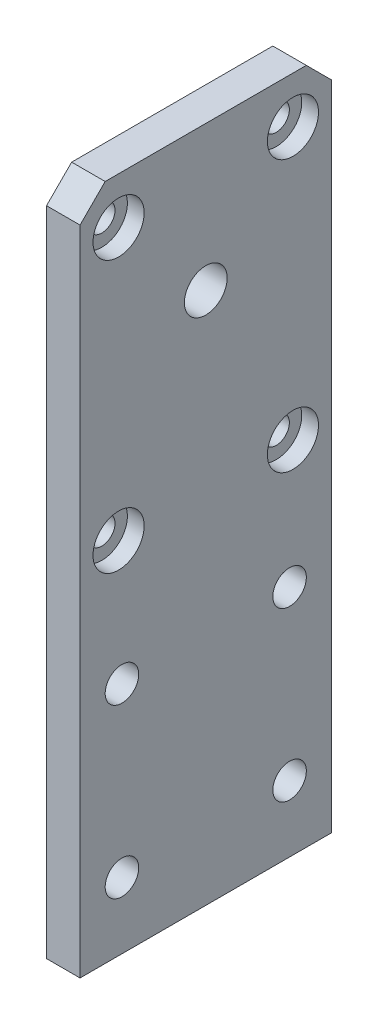
ISO-10303-21;
HEADER;
FILE_DESCRIPTION(('STEP AP214'),'2;1');
FILE_NAME('part.step','',(''),(''),'','','');
FILE_SCHEMA(('AUTOMOTIVE_DESIGN { 1 0 10303 214 1 1 1 1 }'));
ENDSEC;
DATA;
#1=APPLICATION_CONTEXT('core data for automotive mechanical design processes');
#2=APPLICATION_PROTOCOL_DEFINITION('international standard','automotive_design',2000,#1);
#3=PRODUCT_CONTEXT('',#1,'mechanical');
#4=PRODUCT('Part','Part','',(#3));
#5=PRODUCT_RELATED_PRODUCT_CATEGORY('part','',(#4));
#6=PRODUCT_DEFINITION_FORMATION('','',#4);
#7=PRODUCT_DEFINITION_CONTEXT('part definition',#1,'design');
#8=PRODUCT_DEFINITION('design','',#6,#7);
#9=PRODUCT_DEFINITION_SHAPE('','',#8);
#10=(LENGTH_UNIT() NAMED_UNIT(*) SI_UNIT(.MILLI.,.METRE.));
#11=(NAMED_UNIT(*) PLANE_ANGLE_UNIT() SI_UNIT($,.RADIAN.));
#12=(NAMED_UNIT(*) SI_UNIT($,.STERADIAN.) SOLID_ANGLE_UNIT());
#13=UNCERTAINTY_MEASURE_WITH_UNIT(LENGTH_MEASURE(1.E-05),#10,'distance_accuracy_value','');
#14=(GEOMETRIC_REPRESENTATION_CONTEXT(3) GLOBAL_UNCERTAINTY_ASSIGNED_CONTEXT((#13)) GLOBAL_UNIT_ASSIGNED_CONTEXT((#10,
#11,#12)) REPRESENTATION_CONTEXT('',''));
#15=CARTESIAN_POINT('',(0.,0.,0.));
#16=DIRECTION('',(0.,0.,1.));
#17=DIRECTION('',(1.,0.,0.));
#18=AXIS2_PLACEMENT_3D('',#15,#16,#17);
#19=CARTESIAN_POINT('',(4.,-40.4,-15.));
#20=DIRECTION('',(0.,0.,1.));
#21=DIRECTION('',(1.,0.,0.));
#22=AXIS2_PLACEMENT_3D('',#19,#20,#21);
#23=PLANE('',#22);
#24=DIRECTION('',(0.,1.,0.));
#25=VECTOR('',#24,1.);
#26=CARTESIAN_POINT('',(0.,-40.4,-15.));
#27=LINE('',#26,#25);
#28=CARTESIAN_POINT('',(0.,-40.4,-15.));
#29=VERTEX_POINT('',#28);
#30=CARTESIAN_POINT('',(0.,37.4,-15.));
#31=VERTEX_POINT('',#30);
#32=EDGE_CURVE('E111',#29,#31,#27,.T.);
#33=ORIENTED_EDGE('',*,*,#32,.T.);
#34=DIRECTION('',(1.,0.,0.));
#35=VECTOR('',#34,1.);
#36=CARTESIAN_POINT('',(4.,37.4,-15.));
#37=LINE('',#36,#35);
#38=CARTESIAN_POINT('',(4.,37.3999999999999,-15.));
#39=VERTEX_POINT('',#38);
#40=EDGE_CURVE('E55',#31,#39,#37,.T.);
#41=ORIENTED_EDGE('',*,*,#40,.T.);
#42=DIRECTION('',(0.,1.,0.));
#43=VECTOR('',#42,1.);
#44=CARTESIAN_POINT('',(4.,-40.4,-15.));
#45=LINE('',#44,#43);
#46=CARTESIAN_POINT('',(4.,-40.4,-15.));
#47=VERTEX_POINT('',#46);
#48=EDGE_CURVE('E119',#47,#39,#45,.T.);
#49=ORIENTED_EDGE('',*,*,#48,.F.);
#50=DIRECTION('',(-1.,0.,0.));
#51=VECTOR('',#50,1.);
#52=CARTESIAN_POINT('',(4.,-40.4,-15.));
#53=LINE('',#52,#51);
#54=EDGE_CURVE('E103',#47,#29,#53,.T.);
#55=ORIENTED_EDGE('',*,*,#54,.T.);
#56=EDGE_LOOP('',(#33,#41,#49,#55));
#57=FACE_BOUND('',#56,.T.);
#58=ADVANCED_FACE('F32',(#57),#23,.F.);
#59=CARTESIAN_POINT('',(4.,40.4,15.));
#60=DIRECTION('',(0.,-1.,0.));
#61=DIRECTION('',(0.,0.,-1.));
#62=AXIS2_PLACEMENT_3D('',#59,#60,#61);
#63=PLANE('',#62);
#64=DIRECTION('',(0.,0.,1.));
#65=VECTOR('',#64,1.);
#66=CARTESIAN_POINT('',(4.,40.4,15.));
#67=LINE('',#66,#65);
#68=CARTESIAN_POINT('',(4.,40.4,-12.));
#69=VERTEX_POINT('',#68);
#70=CARTESIAN_POINT('',(4.,40.4,12.));
#71=VERTEX_POINT('',#70);
#72=EDGE_CURVE('E93',#69,#71,#67,.T.);
#73=ORIENTED_EDGE('',*,*,#72,.F.);
#74=DIRECTION('',(-1.,0.,0.));
#75=VECTOR('',#74,1.);
#76=CARTESIAN_POINT('',(4.,40.4,-12.));
#77=LINE('',#76,#75);
#78=CARTESIAN_POINT('',(0.,40.4,-12.));
#79=VERTEX_POINT('',#78);
#80=EDGE_CURVE('E122',#69,#79,#77,.T.);
#81=ORIENTED_EDGE('',*,*,#80,.T.);
#82=DIRECTION('',(0.,0.,1.));
#83=VECTOR('',#82,1.);
#84=CARTESIAN_POINT('',(0.,40.4,15.));
#85=LINE('',#84,#83);
#86=CARTESIAN_POINT('',(0.,40.4,12.));
#87=VERTEX_POINT('',#86);
#88=EDGE_CURVE('E113',#79,#87,#85,.T.);
#89=ORIENTED_EDGE('',*,*,#88,.T.);
#90=DIRECTION('',(1.,0.,0.));
#91=VECTOR('',#90,1.);
#92=CARTESIAN_POINT('',(4.,40.4,12.));
#93=LINE('',#92,#91);
#94=EDGE_CURVE('E102',#87,#71,#93,.T.);
#95=ORIENTED_EDGE('',*,*,#94,.T.);
#96=EDGE_LOOP('',(#73,#81,#89,#95));
#97=FACE_BOUND('',#96,.T.);
#98=ADVANCED_FACE('F135',(#97),#63,.F.);
#99=CARTESIAN_POINT('',(4.,-40.4,15.));
#100=DIRECTION('',(0.,0.,-1.));
#101=DIRECTION('',(-1.,0.,0.));
#102=AXIS2_PLACEMENT_3D('',#99,#100,#101);
#103=PLANE('',#102);
#104=DIRECTION('',(0.,-1.,0.));
#105=VECTOR('',#104,1.);
#106=CARTESIAN_POINT('',(4.,-40.4,15.));
#107=LINE('',#106,#105);
#108=CARTESIAN_POINT('',(4.,37.4,15.));
#109=VERTEX_POINT('',#108);
#110=CARTESIAN_POINT('',(4.,-40.4,15.));
#111=VERTEX_POINT('',#110);
#112=EDGE_CURVE('E85',#109,#111,#107,.T.);
#113=ORIENTED_EDGE('',*,*,#112,.F.);
#114=DIRECTION('',(-1.,0.,0.));
#115=VECTOR('',#114,1.);
#116=CARTESIAN_POINT('',(4.,37.4,15.));
#117=LINE('',#116,#115);
#118=CARTESIAN_POINT('',(0.,37.4,15.));
#119=VERTEX_POINT('',#118);
#120=EDGE_CURVE('E11',#109,#119,#117,.T.);
#121=ORIENTED_EDGE('',*,*,#120,.T.);
#122=DIRECTION('',(0.,-1.,0.));
#123=VECTOR('',#122,1.);
#124=CARTESIAN_POINT('',(0.,-40.4,15.));
#125=LINE('',#124,#123);
#126=CARTESIAN_POINT('',(0.,-40.4,15.));
#127=VERTEX_POINT('',#126);
#128=EDGE_CURVE('E99',#119,#127,#125,.T.);
#129=ORIENTED_EDGE('',*,*,#128,.T.);
#130=DIRECTION('',(-1.,0.,0.));
#131=VECTOR('',#130,1.);
#132=CARTESIAN_POINT('',(4.,-40.4,15.));
#133=LINE('',#132,#131);
#134=EDGE_CURVE('E96',#111,#127,#133,.T.);
#135=ORIENTED_EDGE('',*,*,#134,.F.);
#136=EDGE_LOOP('',(#113,#121,#129,#135));
#137=FACE_BOUND('',#136,.T.);
#138=ADVANCED_FACE('F97',(#137),#103,.F.);
#139=CARTESIAN_POINT('',(4.,-40.4,15.));
#140=DIRECTION('',(0.,1.,0.));
#141=DIRECTION('',(0.,0.,1.));
#142=AXIS2_PLACEMENT_3D('',#139,#140,#141);
#143=PLANE('',#142);
#144=DIRECTION('',(0.,0.,-1.));
#145=VECTOR('',#144,1.);
#146=CARTESIAN_POINT('',(0.,-40.4,15.));
#147=LINE('',#146,#145);
#148=EDGE_CURVE('E118',#127,#29,#147,.T.);
#149=ORIENTED_EDGE('',*,*,#148,.T.);
#150=ORIENTED_EDGE('',*,*,#54,.F.);
#151=DIRECTION('',(0.,0.,-1.));
#152=VECTOR('',#151,1.);
#153=CARTESIAN_POINT('',(4.,-40.4,15.));
#154=LINE('',#153,#152);
#155=EDGE_CURVE('E89',#111,#47,#154,.T.);
#156=ORIENTED_EDGE('',*,*,#155,.F.);
#157=ORIENTED_EDGE('',*,*,#134,.T.);
#158=EDGE_LOOP('',(#149,#150,#156,#157));
#159=FACE_BOUND('',#158,.T.);
#160=ADVANCED_FACE('F105',(#159),#143,.F.);
#161=CARTESIAN_POINT('',(4.,0.,0.));
#162=DIRECTION('',(-1.,0.,0.));
#163=DIRECTION('',(0.,0.,1.));
#164=AXIS2_PLACEMENT_3D('',#161,#162,#163);
#165=PLANE('',#164);
#166=CARTESIAN_POINT('',(4.,2.49999999999999,-10.4000000000002));
#167=DIRECTION('',(-1.,0.,0.));
#168=DIRECTION('',(0.,0.,1.));
#169=AXIS2_PLACEMENT_3D('',#166,#167,#168);
#170=CIRCLE('',#169,3.05);
#171=CARTESIAN_POINT('',(4.,2.49999999999999,-7.35000000000023));
#172=VERTEX_POINT('',#171);
#173=EDGE_CURVE('E192',#172,#172,#170,.T.);
#174=ORIENTED_EDGE('',*,*,#173,.T.);
#175=EDGE_LOOP('',(#174));
#176=FACE_BOUND('',#175,.T.);
#177=CARTESIAN_POINT('',(4.,2.49999999999999,10.3999999999998));
#178=DIRECTION('',(-1.,0.,0.));
#179=DIRECTION('',(0.,0.,1.));
#180=AXIS2_PLACEMENT_3D('',#177,#178,#179);
#181=CIRCLE('',#180,3.05);
#182=CARTESIAN_POINT('',(4.,2.49999999999999,13.4499999999998));
#183=VERTEX_POINT('',#182);
#184=EDGE_CURVE('E186',#183,#183,#181,.T.);
#185=ORIENTED_EDGE('',*,*,#184,.T.);
#186=EDGE_LOOP('',(#185));
#187=FACE_BOUND('',#186,.T.);
#188=CARTESIAN_POINT('',(4.,34.85,10.3999999999998));
#189=DIRECTION('',(-1.,0.,0.));
#190=DIRECTION('',(0.,0.,1.));
#191=AXIS2_PLACEMENT_3D('',#188,#189,#190);
#192=CIRCLE('',#191,3.04999999999999);
#193=CARTESIAN_POINT('',(4.,34.85,13.4499999999998));
#194=VERTEX_POINT('',#193);
#195=EDGE_CURVE('E180',#194,#194,#192,.T.);
#196=ORIENTED_EDGE('',*,*,#195,.T.);
#197=EDGE_LOOP('',(#196));
#198=FACE_BOUND('',#197,.T.);
#199=CARTESIAN_POINT('',(4.,34.85,-10.4000000000002));
#200=DIRECTION('',(-1.,0.,0.));
#201=DIRECTION('',(0.,0.,1.));
#202=AXIS2_PLACEMENT_3D('',#199,#200,#201);
#203=CIRCLE('',#202,3.04999999999999);
#204=CARTESIAN_POINT('',(4.,34.85,-7.35000000000023));
#205=VERTEX_POINT('',#204);
#206=EDGE_CURVE('E174',#205,#205,#203,.T.);
#207=ORIENTED_EDGE('',*,*,#206,.T.);
#208=EDGE_LOOP('',(#207));
#209=FACE_BOUND('',#208,.T.);
#210=CARTESIAN_POINT('',(4.,23.15,0.));
#211=DIRECTION('',(-1.,0.,0.));
#212=DIRECTION('',(0.,0.,1.));
#213=AXIS2_PLACEMENT_3D('',#210,#211,#212);
#214=CIRCLE('',#213,2.55);
#215=CARTESIAN_POINT('',(4.,23.15,2.55));
#216=VERTEX_POINT('',#215);
#217=EDGE_CURVE('E165',#216,#216,#214,.T.);
#218=ORIENTED_EDGE('',*,*,#217,.T.);
#219=EDGE_LOOP('',(#218));
#220=FACE_BOUND('',#219,.T.);
#221=CARTESIAN_POINT('',(4.,-32.5,-10.));
#222=DIRECTION('',(1.,0.,0.));
#223=DIRECTION('',(0.,0.,-1.));
#224=AXIS2_PLACEMENT_3D('',#221,#222,#223);
#225=CIRCLE('',#224,2.00000000000001);
#226=CARTESIAN_POINT('',(4.,-32.5,-12.));
#227=VERTEX_POINT('',#226);
#228=EDGE_CURVE('E162',#227,#227,#225,.T.);
#229=ORIENTED_EDGE('',*,*,#228,.F.);
#230=EDGE_LOOP('',(#229));
#231=FACE_BOUND('',#230,.T.);
#232=CARTESIAN_POINT('',(4.,-32.5,10.));
#233=DIRECTION('',(1.,0.,0.));
#234=DIRECTION('',(0.,0.,-1.));
#235=AXIS2_PLACEMENT_3D('',#232,#233,#234);
#236=CIRCLE('',#235,2.);
#237=CARTESIAN_POINT('',(4.,-32.5,8.));
#238=VERTEX_POINT('',#237);
#239=EDGE_CURVE('E156',#238,#238,#236,.T.);
#240=ORIENTED_EDGE('',*,*,#239,.F.);
#241=EDGE_LOOP('',(#240));
#242=FACE_BOUND('',#241,.T.);
#243=CARTESIAN_POINT('',(4.,-12.5,-10.));
#244=DIRECTION('',(1.,0.,0.));
#245=DIRECTION('',(0.,0.,-1.));
#246=AXIS2_PLACEMENT_3D('',#243,#244,#245);
#247=CIRCLE('',#246,2.00000000000001);
#248=CARTESIAN_POINT('',(4.,-12.5,-12.));
#249=VERTEX_POINT('',#248);
#250=EDGE_CURVE('E150',#249,#249,#247,.T.);
#251=ORIENTED_EDGE('',*,*,#250,.F.);
#252=EDGE_LOOP('',(#251));
#253=FACE_BOUND('',#252,.T.);
#254=CARTESIAN_POINT('',(4.,-12.5,10.));
#255=DIRECTION('',(1.,0.,0.));
#256=DIRECTION('',(0.,0.,-1.));
#257=AXIS2_PLACEMENT_3D('',#254,#255,#256);
#258=CIRCLE('',#257,2.);
#259=CARTESIAN_POINT('',(4.,-12.5,8.));
#260=VERTEX_POINT('',#259);
#261=EDGE_CURVE('E144',#260,#260,#258,.T.);
#262=ORIENTED_EDGE('',*,*,#261,.F.);
#263=EDGE_LOOP('',(#262));
#264=FACE_BOUND('',#263,.T.);
#265=ORIENTED_EDGE('',*,*,#48,.T.);
#266=DIRECTION('',(0.,-0.707106781186548,-0.707106781186547));
#267=VECTOR('',#266,1.);
#268=CARTESIAN_POINT('',(4.,40.4,-12.));
#269=LINE('',#268,#267);
#270=EDGE_CURVE('E40',#39,#69,#269,.F.);
#271=ORIENTED_EDGE('',*,*,#270,.T.);
#272=ORIENTED_EDGE('',*,*,#72,.T.);
#273=DIRECTION('',(0.,0.707106781186545,-0.70710678118655));
#274=VECTOR('',#273,1.);
#275=CARTESIAN_POINT('',(4.,37.4,15.));
#276=LINE('',#275,#274);
#277=EDGE_CURVE('E47',#71,#109,#276,.F.);
#278=ORIENTED_EDGE('',*,*,#277,.T.);
#279=ORIENTED_EDGE('',*,*,#112,.T.);
#280=ORIENTED_EDGE('',*,*,#155,.T.);
#281=EDGE_LOOP('',(#265,#271,#272,#278,#279,#280));
#282=FACE_BOUND('',#281,.T.);
#283=ADVANCED_FACE('F87',(#176,#187,#198,#209,#220,#231,#242,#253,#264,#282),#165,.F.);
#284=CARTESIAN_POINT('',(0.,0.,0.));
#285=DIRECTION('',(-1.,0.,0.));
#286=DIRECTION('',(0.,0.,1.));
#287=AXIS2_PLACEMENT_3D('',#284,#285,#286);
#288=PLANE('',#287);
#289=CARTESIAN_POINT('',(0.,2.49999999999999,10.3999999999998));
#290=DIRECTION('',(1.,0.,0.));
#291=DIRECTION('',(0.,0.,-1.));
#292=AXIS2_PLACEMENT_3D('',#289,#290,#291);
#293=CIRCLE('',#292,1.575);
#294=CARTESIAN_POINT('',(0.,2.49999999999999,8.82499999999978));
#295=VERTEX_POINT('',#294);
#296=EDGE_CURVE('E213',#295,#295,#293,.T.);
#297=ORIENTED_EDGE('',*,*,#296,.T.);
#298=EDGE_LOOP('',(#297));
#299=FACE_BOUND('',#298,.T.);
#300=CARTESIAN_POINT('',(0.,2.49999999999999,-10.4000000000002));
#301=DIRECTION('',(1.,0.,0.));
#302=DIRECTION('',(0.,0.,-1.));
#303=AXIS2_PLACEMENT_3D('',#300,#301,#302);
#304=CIRCLE('',#303,1.575);
#305=CARTESIAN_POINT('',(0.,2.49999999999999,-11.9750000000002));
#306=VERTEX_POINT('',#305);
#307=EDGE_CURVE('E207',#306,#306,#304,.T.);
#308=ORIENTED_EDGE('',*,*,#307,.T.);
#309=EDGE_LOOP('',(#308));
#310=FACE_BOUND('',#309,.T.);
#311=CARTESIAN_POINT('',(0.,34.85,-10.4000000000002));
#312=DIRECTION('',(1.,0.,0.));
#313=DIRECTION('',(0.,0.,-1.));
#314=AXIS2_PLACEMENT_3D('',#311,#312,#313);
#315=CIRCLE('',#314,1.575);
#316=CARTESIAN_POINT('',(0.,34.85,-11.9750000000002));
#317=VERTEX_POINT('',#316);
#318=EDGE_CURVE('E201',#317,#317,#315,.T.);
#319=ORIENTED_EDGE('',*,*,#318,.T.);
#320=EDGE_LOOP('',(#319));
#321=FACE_BOUND('',#320,.T.);
#322=CARTESIAN_POINT('',(0.,34.85,10.3999999999998));
#323=DIRECTION('',(1.,0.,0.));
#324=DIRECTION('',(0.,0.,-1.));
#325=AXIS2_PLACEMENT_3D('',#322,#323,#324);
#326=CIRCLE('',#325,1.575);
#327=CARTESIAN_POINT('',(0.,34.85,8.82499999999979));
#328=VERTEX_POINT('',#327);
#329=EDGE_CURVE('E195',#328,#328,#326,.T.);
#330=ORIENTED_EDGE('',*,*,#329,.T.);
#331=EDGE_LOOP('',(#330));
#332=FACE_BOUND('',#331,.T.);
#333=CARTESIAN_POINT('',(0.,23.15,0.));
#334=DIRECTION('',(-1.,0.,0.));
#335=DIRECTION('',(0.,0.,1.));
#336=AXIS2_PLACEMENT_3D('',#333,#334,#335);
#337=CIRCLE('',#336,2.55);
#338=CARTESIAN_POINT('',(0.,23.15,2.55));
#339=VERTEX_POINT('',#338);
#340=EDGE_CURVE('E168',#339,#339,#337,.T.);
#341=ORIENTED_EDGE('',*,*,#340,.F.);
#342=EDGE_LOOP('',(#341));
#343=FACE_BOUND('',#342,.T.);
#344=CARTESIAN_POINT('',(0.,-32.5,-10.));
#345=DIRECTION('',(1.,0.,0.));
#346=DIRECTION('',(0.,0.,-1.));
#347=AXIS2_PLACEMENT_3D('',#344,#345,#346);
#348=CIRCLE('',#347,2.00000000000001);
#349=CARTESIAN_POINT('',(0.,-32.5,-12.));
#350=VERTEX_POINT('',#349);
#351=EDGE_CURVE('E159',#350,#350,#348,.T.);
#352=ORIENTED_EDGE('',*,*,#351,.T.);
#353=EDGE_LOOP('',(#352));
#354=FACE_BOUND('',#353,.T.);
#355=CARTESIAN_POINT('',(0.,-32.5,10.));
#356=DIRECTION('',(1.,0.,0.));
#357=DIRECTION('',(0.,0.,-1.));
#358=AXIS2_PLACEMENT_3D('',#355,#356,#357);
#359=CIRCLE('',#358,2.);
#360=CARTESIAN_POINT('',(0.,-32.5,8.));
#361=VERTEX_POINT('',#360);
#362=EDGE_CURVE('E153',#361,#361,#359,.T.);
#363=ORIENTED_EDGE('',*,*,#362,.T.);
#364=EDGE_LOOP('',(#363));
#365=FACE_BOUND('',#364,.T.);
#366=CARTESIAN_POINT('',(0.,-12.5,-10.));
#367=DIRECTION('',(1.,0.,0.));
#368=DIRECTION('',(0.,0.,-1.));
#369=AXIS2_PLACEMENT_3D('',#366,#367,#368);
#370=CIRCLE('',#369,2.00000000000001);
#371=CARTESIAN_POINT('',(0.,-12.5,-12.));
#372=VERTEX_POINT('',#371);
#373=EDGE_CURVE('E147',#372,#372,#370,.T.);
#374=ORIENTED_EDGE('',*,*,#373,.T.);
#375=EDGE_LOOP('',(#374));
#376=FACE_BOUND('',#375,.T.);
#377=CARTESIAN_POINT('',(0.,-12.5,10.));
#378=DIRECTION('',(1.,0.,0.));
#379=DIRECTION('',(0.,0.,-1.));
#380=AXIS2_PLACEMENT_3D('',#377,#378,#379);
#381=CIRCLE('',#380,2.);
#382=CARTESIAN_POINT('',(0.,-12.5,8.));
#383=VERTEX_POINT('',#382);
#384=EDGE_CURVE('E114',#383,#383,#381,.T.);
#385=ORIENTED_EDGE('',*,*,#384,.T.);
#386=EDGE_LOOP('',(#385));
#387=FACE_BOUND('',#386,.T.);
#388=ORIENTED_EDGE('',*,*,#88,.F.);
#389=DIRECTION('',(0.,0.707106781186548,0.707106781186547));
#390=VECTOR('',#389,1.);
#391=CARTESIAN_POINT('',(0.,26.1999999999999,-26.2));
#392=LINE('',#391,#390);
#393=EDGE_CURVE('E127',#79,#31,#392,.F.);
#394=ORIENTED_EDGE('',*,*,#393,.T.);
#395=ORIENTED_EDGE('',*,*,#32,.F.);
#396=ORIENTED_EDGE('',*,*,#148,.F.);
#397=ORIENTED_EDGE('',*,*,#128,.F.);
#398=DIRECTION('',(0.,-0.707106781186545,0.70710678118655));
#399=VECTOR('',#398,1.);
#400=CARTESIAN_POINT('',(0.,26.2000000000001,26.1999999999999));
#401=LINE('',#400,#399);
#402=EDGE_CURVE('E125',#119,#87,#401,.F.);
#403=ORIENTED_EDGE('',*,*,#402,.T.);
#404=EDGE_LOOP('',(#388,#394,#395,#396,#397,#403));
#405=FACE_BOUND('',#404,.T.);
#406=ADVANCED_FACE('F141',(#299,#310,#321,#332,#343,#354,#365,#376,#387,#405),#288,.T.);
#407=CARTESIAN_POINT('',(0.,-12.5,10.));
#408=DIRECTION('',(1.,0.,0.));
#409=DIRECTION('',(0.,0.,-1.));
#410=AXIS2_PLACEMENT_3D('',#407,#408,#409);
#411=CYLINDRICAL_SURFACE('',#410,2.);
#412=ORIENTED_EDGE('',*,*,#384,.F.);
#413=EDGE_LOOP('',(#412));
#414=FACE_BOUND('',#413,.T.);
#415=ORIENTED_EDGE('',*,*,#261,.T.);
#416=EDGE_LOOP('',(#415));
#417=FACE_BOUND('',#416,.T.);
#418=ADVANCED_FACE('F263',(#414,#417),#411,.F.);
#419=CARTESIAN_POINT('',(0.,-12.5,-10.));
#420=DIRECTION('',(1.,0.,0.));
#421=DIRECTION('',(0.,0.,-1.));
#422=AXIS2_PLACEMENT_3D('',#419,#420,#421);
#423=CYLINDRICAL_SURFACE('',#422,2.00000000000001);
#424=ORIENTED_EDGE('',*,*,#373,.F.);
#425=EDGE_LOOP('',(#424));
#426=FACE_BOUND('',#425,.T.);
#427=ORIENTED_EDGE('',*,*,#250,.T.);
#428=EDGE_LOOP('',(#427));
#429=FACE_BOUND('',#428,.T.);
#430=ADVANCED_FACE('F265',(#426,#429),#423,.F.);
#431=CARTESIAN_POINT('',(0.,-32.5,10.));
#432=DIRECTION('',(1.,0.,0.));
#433=DIRECTION('',(0.,0.,-1.));
#434=AXIS2_PLACEMENT_3D('',#431,#432,#433);
#435=CYLINDRICAL_SURFACE('',#434,2.);
#436=ORIENTED_EDGE('',*,*,#362,.F.);
#437=EDGE_LOOP('',(#436));
#438=FACE_BOUND('',#437,.T.);
#439=ORIENTED_EDGE('',*,*,#239,.T.);
#440=EDGE_LOOP('',(#439));
#441=FACE_BOUND('',#440,.T.);
#442=ADVANCED_FACE('F272',(#438,#441),#435,.F.);
#443=CARTESIAN_POINT('',(0.,-32.5,-10.));
#444=DIRECTION('',(1.,0.,0.));
#445=DIRECTION('',(0.,0.,-1.));
#446=AXIS2_PLACEMENT_3D('',#443,#444,#445);
#447=CYLINDRICAL_SURFACE('',#446,2.00000000000001);
#448=ORIENTED_EDGE('',*,*,#351,.F.);
#449=EDGE_LOOP('',(#448));
#450=FACE_BOUND('',#449,.T.);
#451=ORIENTED_EDGE('',*,*,#228,.T.);
#452=EDGE_LOOP('',(#451));
#453=FACE_BOUND('',#452,.T.);
#454=ADVANCED_FACE('F442',(#450,#453),#447,.F.);
#455=CARTESIAN_POINT('',(4.,23.15,0.));
#456=DIRECTION('',(-1.,0.,0.));
#457=DIRECTION('',(0.,0.,1.));
#458=AXIS2_PLACEMENT_3D('',#455,#456,#457);
#459=CYLINDRICAL_SURFACE('',#458,2.55);
#460=ORIENTED_EDGE('',*,*,#217,.F.);
#461=EDGE_LOOP('',(#460));
#462=FACE_BOUND('',#461,.T.);
#463=ORIENTED_EDGE('',*,*,#340,.T.);
#464=EDGE_LOOP('',(#463));
#465=FACE_BOUND('',#464,.T.);
#466=ADVANCED_FACE('F432',(#462,#465),#459,.F.);
#467=CARTESIAN_POINT('',(2.,34.85,-10.4000000000002));
#468=DIRECTION('',(1.,0.,0.));
#469=DIRECTION('',(0.,0.,-1.));
#470=AXIS2_PLACEMENT_3D('',#467,#468,#469);
#471=CYLINDRICAL_SURFACE('',#470,3.04999999999999);
#472=CARTESIAN_POINT('',(2.,34.85,-10.4000000000002));
#473=DIRECTION('',(-1.,0.,0.));
#474=DIRECTION('',(0.,0.,1.));
#475=AXIS2_PLACEMENT_3D('',#472,#473,#474);
#476=CIRCLE('',#475,3.04999999999999);
#477=CARTESIAN_POINT('',(2.,34.85,-7.35000000000023));
#478=VERTEX_POINT('',#477);
#479=EDGE_CURVE('E171',#478,#478,#476,.T.);
#480=ORIENTED_EDGE('',*,*,#479,.T.);
#481=EDGE_LOOP('',(#480));
#482=FACE_BOUND('',#481,.T.);
#483=ORIENTED_EDGE('',*,*,#206,.F.);
#484=EDGE_LOOP('',(#483));
#485=FACE_BOUND('',#484,.T.);
#486=ADVANCED_FACE('F403',(#482,#485),#471,.F.);
#487=CARTESIAN_POINT('',(2.,34.85,-10.4000000000002));
#488=DIRECTION('',(-1.,0.,0.));
#489=DIRECTION('',(0.,0.,1.));
#490=AXIS2_PLACEMENT_3D('',#487,#488,#489);
#491=PLANE('',#490);
#492=CARTESIAN_POINT('',(2.,34.85,-10.4000000000002));
#493=DIRECTION('',(1.,0.,0.));
#494=DIRECTION('',(0.,0.,-1.));
#495=AXIS2_PLACEMENT_3D('',#492,#493,#494);
#496=CIRCLE('',#495,1.575);
#497=CARTESIAN_POINT('',(2.,34.85,-11.9750000000002));
#498=VERTEX_POINT('',#497);
#499=EDGE_CURVE('E204',#498,#498,#496,.T.);
#500=ORIENTED_EDGE('',*,*,#499,.F.);
#501=EDGE_LOOP('',(#500));
#502=FACE_BOUND('',#501,.T.);
#503=ORIENTED_EDGE('',*,*,#479,.F.);
#504=EDGE_LOOP('',(#503));
#505=FACE_BOUND('',#504,.T.);
#506=ADVANCED_FACE('F398',(#502,#505),#491,.F.);
#507=CARTESIAN_POINT('',(2.,34.85,10.3999999999998));
#508=DIRECTION('',(1.,0.,0.));
#509=DIRECTION('',(0.,0.,-1.));
#510=AXIS2_PLACEMENT_3D('',#507,#508,#509);
#511=CYLINDRICAL_SURFACE('',#510,3.04999999999999);
#512=CARTESIAN_POINT('',(2.,34.85,10.3999999999998));
#513=DIRECTION('',(-1.,0.,0.));
#514=DIRECTION('',(0.,0.,1.));
#515=AXIS2_PLACEMENT_3D('',#512,#513,#514);
#516=CIRCLE('',#515,3.04999999999999);
#517=CARTESIAN_POINT('',(2.,34.85,13.4499999999998));
#518=VERTEX_POINT('',#517);
#519=EDGE_CURVE('E177',#518,#518,#516,.T.);
#520=ORIENTED_EDGE('',*,*,#519,.T.);
#521=EDGE_LOOP('',(#520));
#522=FACE_BOUND('',#521,.T.);
#523=ORIENTED_EDGE('',*,*,#195,.F.);
#524=EDGE_LOOP('',(#523));
#525=FACE_BOUND('',#524,.T.);
#526=ADVANCED_FACE('F390',(#522,#525),#511,.F.);
#527=CARTESIAN_POINT('',(2.,34.85,10.3999999999998));
#528=DIRECTION('',(-1.,0.,0.));
#529=DIRECTION('',(0.,0.,1.));
#530=AXIS2_PLACEMENT_3D('',#527,#528,#529);
#531=PLANE('',#530);
#532=CARTESIAN_POINT('',(2.,34.85,10.3999999999998));
#533=DIRECTION('',(1.,0.,0.));
#534=DIRECTION('',(0.,0.,-1.));
#535=AXIS2_PLACEMENT_3D('',#532,#533,#534);
#536=CIRCLE('',#535,1.575);
#537=CARTESIAN_POINT('',(2.,34.85,8.82499999999979));
#538=VERTEX_POINT('',#537);
#539=EDGE_CURVE('E198',#538,#538,#536,.T.);
#540=ORIENTED_EDGE('',*,*,#539,.F.);
#541=EDGE_LOOP('',(#540));
#542=FACE_BOUND('',#541,.T.);
#543=ORIENTED_EDGE('',*,*,#519,.F.);
#544=EDGE_LOOP('',(#543));
#545=FACE_BOUND('',#544,.T.);
#546=ADVANCED_FACE('F241',(#542,#545),#531,.F.);
#547=CARTESIAN_POINT('',(2.,2.49999999999999,10.3999999999998));
#548=DIRECTION('',(1.,0.,0.));
#549=DIRECTION('',(0.,0.,-1.));
#550=AXIS2_PLACEMENT_3D('',#547,#548,#549);
#551=CYLINDRICAL_SURFACE('',#550,3.05);
#552=CARTESIAN_POINT('',(2.,2.49999999999999,10.3999999999998));
#553=DIRECTION('',(-1.,0.,0.));
#554=DIRECTION('',(0.,0.,1.));
#555=AXIS2_PLACEMENT_3D('',#552,#553,#554);
#556=CIRCLE('',#555,3.05);
#557=CARTESIAN_POINT('',(2.,2.49999999999999,13.4499999999998));
#558=VERTEX_POINT('',#557);
#559=EDGE_CURVE('E183',#558,#558,#556,.T.);
#560=ORIENTED_EDGE('',*,*,#559,.T.);
#561=EDGE_LOOP('',(#560));
#562=FACE_BOUND('',#561,.T.);
#563=ORIENTED_EDGE('',*,*,#184,.F.);
#564=EDGE_LOOP('',(#563));
#565=FACE_BOUND('',#564,.T.);
#566=ADVANCED_FACE('F235',(#562,#565),#551,.F.);
#567=CARTESIAN_POINT('',(2.,2.49999999999999,10.3999999999998));
#568=DIRECTION('',(-1.,0.,0.));
#569=DIRECTION('',(0.,0.,1.));
#570=AXIS2_PLACEMENT_3D('',#567,#568,#569);
#571=PLANE('',#570);
#572=CARTESIAN_POINT('',(2.,2.49999999999999,10.3999999999998));
#573=DIRECTION('',(1.,0.,0.));
#574=DIRECTION('',(0.,0.,-1.));
#575=AXIS2_PLACEMENT_3D('',#572,#573,#574);
#576=CIRCLE('',#575,1.575);
#577=CARTESIAN_POINT('',(2.,2.49999999999999,8.82499999999978));
#578=VERTEX_POINT('',#577);
#579=EDGE_CURVE('E216',#578,#578,#576,.T.);
#580=ORIENTED_EDGE('',*,*,#579,.F.);
#581=EDGE_LOOP('',(#580));
#582=FACE_BOUND('',#581,.T.);
#583=ORIENTED_EDGE('',*,*,#559,.F.);
#584=EDGE_LOOP('',(#583));
#585=FACE_BOUND('',#584,.T.);
#586=ADVANCED_FACE('F231',(#582,#585),#571,.F.);
#587=CARTESIAN_POINT('',(2.,2.49999999999999,-10.4000000000002));
#588=DIRECTION('',(1.,0.,0.));
#589=DIRECTION('',(0.,0.,-1.));
#590=AXIS2_PLACEMENT_3D('',#587,#588,#589);
#591=CYLINDRICAL_SURFACE('',#590,3.05);
#592=CARTESIAN_POINT('',(2.,2.49999999999999,-10.4000000000002));
#593=DIRECTION('',(-1.,0.,0.));
#594=DIRECTION('',(0.,0.,1.));
#595=AXIS2_PLACEMENT_3D('',#592,#593,#594);
#596=CIRCLE('',#595,3.05);
#597=CARTESIAN_POINT('',(2.,2.49999999999999,-7.35000000000023));
#598=VERTEX_POINT('',#597);
#599=EDGE_CURVE('E189',#598,#598,#596,.T.);
#600=ORIENTED_EDGE('',*,*,#599,.T.);
#601=EDGE_LOOP('',(#600));
#602=FACE_BOUND('',#601,.T.);
#603=ORIENTED_EDGE('',*,*,#173,.F.);
#604=EDGE_LOOP('',(#603));
#605=FACE_BOUND('',#604,.T.);
#606=ADVANCED_FACE('F234',(#602,#605),#591,.F.);
#607=CARTESIAN_POINT('',(2.,2.49999999999999,-10.4000000000002));
#608=DIRECTION('',(-1.,0.,0.));
#609=DIRECTION('',(0.,0.,1.));
#610=AXIS2_PLACEMENT_3D('',#607,#608,#609);
#611=PLANE('',#610);
#612=CARTESIAN_POINT('',(2.,2.49999999999999,-10.4000000000002));
#613=DIRECTION('',(1.,0.,0.));
#614=DIRECTION('',(0.,0.,-1.));
#615=AXIS2_PLACEMENT_3D('',#612,#613,#614);
#616=CIRCLE('',#615,1.575);
#617=CARTESIAN_POINT('',(2.,2.49999999999999,-11.9750000000002));
#618=VERTEX_POINT('',#617);
#619=EDGE_CURVE('E210',#618,#618,#616,.T.);
#620=ORIENTED_EDGE('',*,*,#619,.F.);
#621=EDGE_LOOP('',(#620));
#622=FACE_BOUND('',#621,.T.);
#623=ORIENTED_EDGE('',*,*,#599,.F.);
#624=EDGE_LOOP('',(#623));
#625=FACE_BOUND('',#624,.T.);
#626=ADVANCED_FACE('F362',(#622,#625),#611,.F.);
#627=CARTESIAN_POINT('',(0.,34.85,10.3999999999998));
#628=DIRECTION('',(1.,0.,0.));
#629=DIRECTION('',(0.,0.,-1.));
#630=AXIS2_PLACEMENT_3D('',#627,#628,#629);
#631=CYLINDRICAL_SURFACE('',#630,1.575);
#632=ORIENTED_EDGE('',*,*,#329,.F.);
#633=EDGE_LOOP('',(#632));
#634=FACE_BOUND('',#633,.T.);
#635=ORIENTED_EDGE('',*,*,#539,.T.);
#636=EDGE_LOOP('',(#635));
#637=FACE_BOUND('',#636,.T.);
#638=ADVANCED_FACE('F352',(#634,#637),#631,.F.);
#639=CARTESIAN_POINT('',(0.,34.85,-10.4000000000002));
#640=DIRECTION('',(1.,0.,0.));
#641=DIRECTION('',(0.,0.,-1.));
#642=AXIS2_PLACEMENT_3D('',#639,#640,#641);
#643=CYLINDRICAL_SURFACE('',#642,1.575);
#644=ORIENTED_EDGE('',*,*,#318,.F.);
#645=EDGE_LOOP('',(#644));
#646=FACE_BOUND('',#645,.T.);
#647=ORIENTED_EDGE('',*,*,#499,.T.);
#648=EDGE_LOOP('',(#647));
#649=FACE_BOUND('',#648,.T.);
#650=ADVANCED_FACE('F342',(#646,#649),#643,.F.);
#651=CARTESIAN_POINT('',(0.,2.49999999999999,-10.4000000000002));
#652=DIRECTION('',(1.,0.,0.));
#653=DIRECTION('',(0.,0.,-1.));
#654=AXIS2_PLACEMENT_3D('',#651,#652,#653);
#655=CYLINDRICAL_SURFACE('',#654,1.575);
#656=ORIENTED_EDGE('',*,*,#307,.F.);
#657=EDGE_LOOP('',(#656));
#658=FACE_BOUND('',#657,.T.);
#659=ORIENTED_EDGE('',*,*,#619,.T.);
#660=EDGE_LOOP('',(#659));
#661=FACE_BOUND('',#660,.T.);
#662=ADVANCED_FACE('F227',(#658,#661),#655,.F.);
#663=CARTESIAN_POINT('',(0.,2.49999999999999,10.3999999999998));
#664=DIRECTION('',(1.,0.,0.));
#665=DIRECTION('',(0.,0.,-1.));
#666=AXIS2_PLACEMENT_3D('',#663,#664,#665);
#667=CYLINDRICAL_SURFACE('',#666,1.575);
#668=ORIENTED_EDGE('',*,*,#296,.F.);
#669=EDGE_LOOP('',(#668));
#670=FACE_BOUND('',#669,.T.);
#671=ORIENTED_EDGE('',*,*,#579,.T.);
#672=EDGE_LOOP('',(#671));
#673=FACE_BOUND('',#672,.T.);
#674=ADVANCED_FACE('F224',(#670,#673),#667,.F.);
#675=CARTESIAN_POINT('',(4.,40.4,-12.));
#676=DIRECTION('',(0.,-0.707106781186547,0.707106781186548));
#677=DIRECTION('',(-1.,0.,0.));
#678=AXIS2_PLACEMENT_3D('',#675,#676,#677);
#679=PLANE('',#678);
#680=ORIENTED_EDGE('',*,*,#270,.F.);
#681=ORIENTED_EDGE('',*,*,#40,.F.);
#682=ORIENTED_EDGE('',*,*,#393,.F.);
#683=ORIENTED_EDGE('',*,*,#80,.F.);
#684=EDGE_LOOP('',(#680,#681,#682,#683));
#685=FACE_BOUND('',#684,.T.);
#686=ADVANCED_FACE('F138',(#685),#679,.F.);
#687=CARTESIAN_POINT('',(4.,37.4,15.));
#688=DIRECTION('',(0.,-0.70710678118655,-0.707106781186545));
#689=DIRECTION('',(-1.,0.,0.));
#690=AXIS2_PLACEMENT_3D('',#687,#688,#689);
#691=PLANE('',#690);
#692=ORIENTED_EDGE('',*,*,#277,.F.);
#693=ORIENTED_EDGE('',*,*,#94,.F.);
#694=ORIENTED_EDGE('',*,*,#402,.F.);
#695=ORIENTED_EDGE('',*,*,#120,.F.);
#696=EDGE_LOOP('',(#692,#693,#694,#695));
#697=FACE_BOUND('',#696,.T.);
#698=ADVANCED_FACE('F34',(#697),#691,.F.);
#699=CLOSED_SHELL('',(#58,#98,#138,#160,#283,#406,#418,#430,#442,#454,#466,#486,#506,#526,#546,
#566,#586,#606,#626,#638,#650,#662,#674,#686,#698));
#700=MANIFOLD_SOLID_BREP('B2',#699);
#701=ADVANCED_BREP_SHAPE_REPRESENTATION('',(#18,#700),#14);
#702=SHAPE_DEFINITION_REPRESENTATION(#9,#701);
ENDSEC;
END-ISO-10303-21;
